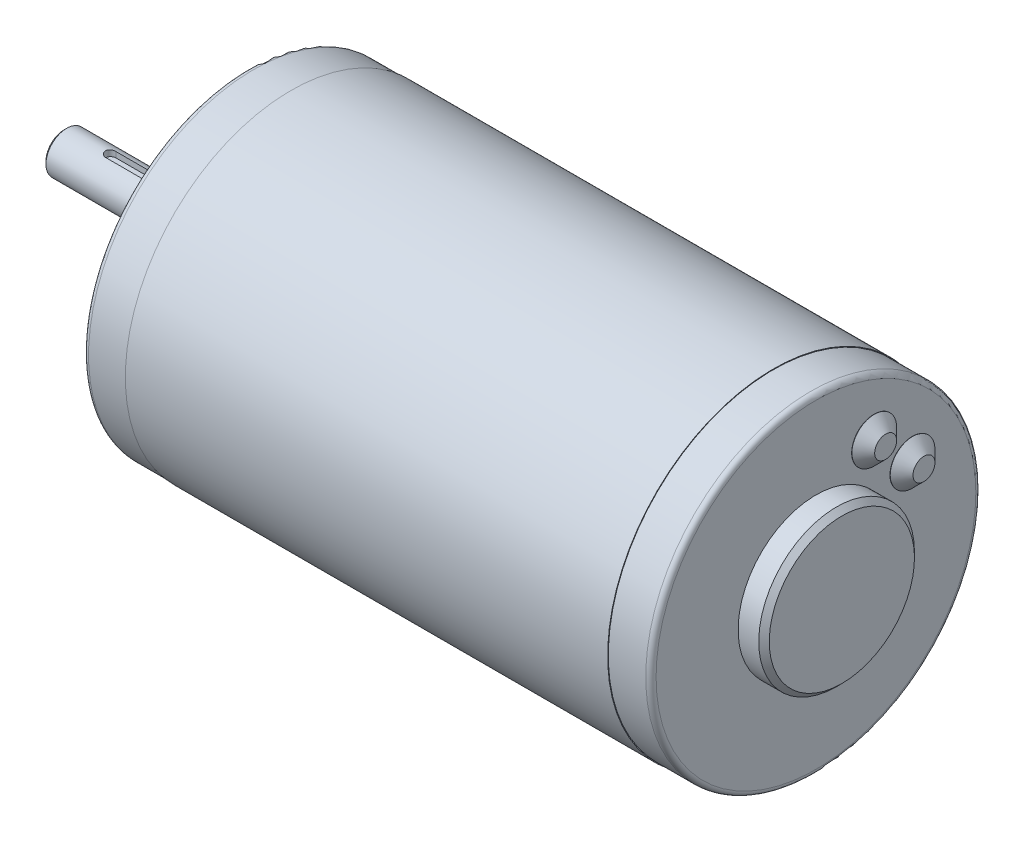
ISO-10303-21;
HEADER;
FILE_DESCRIPTION(('STEP AP214'),'2;1');
FILE_NAME('part.step','',(''),(''),'','','');
FILE_SCHEMA(('AUTOMOTIVE_DESIGN { 1 0 10303 214 1 1 1 1 }'));
ENDSEC;
DATA;
#1=APPLICATION_CONTEXT('core data for automotive mechanical design processes');
#2=APPLICATION_PROTOCOL_DEFINITION('international standard','automotive_design',2000,#1);
#3=PRODUCT_CONTEXT('',#1,'mechanical');
#4=PRODUCT('Part','Part','',(#3));
#5=PRODUCT_RELATED_PRODUCT_CATEGORY('part','',(#4));
#6=PRODUCT_DEFINITION_FORMATION('','',#4);
#7=PRODUCT_DEFINITION_CONTEXT('part definition',#1,'design');
#8=PRODUCT_DEFINITION('design','',#6,#7);
#9=PRODUCT_DEFINITION_SHAPE('','',#8);
#10=(LENGTH_UNIT() NAMED_UNIT(*) SI_UNIT(.MILLI.,.METRE.));
#11=(NAMED_UNIT(*) PLANE_ANGLE_UNIT() SI_UNIT($,.RADIAN.));
#12=(NAMED_UNIT(*) SI_UNIT($,.STERADIAN.) SOLID_ANGLE_UNIT());
#13=UNCERTAINTY_MEASURE_WITH_UNIT(LENGTH_MEASURE(1.E-05),#10,'distance_accuracy_value','');
#14=(GEOMETRIC_REPRESENTATION_CONTEXT(3) GLOBAL_UNCERTAINTY_ASSIGNED_CONTEXT((#13)) GLOBAL_UNIT_ASSIGNED_CONTEXT((#10,
#11,#12)) REPRESENTATION_CONTEXT('',''));
#15=CARTESIAN_POINT('',(0.,0.,0.));
#16=DIRECTION('',(0.,0.,1.));
#17=DIRECTION('',(1.,0.,0.));
#18=AXIS2_PLACEMENT_3D('',#15,#16,#17);
#19=CARTESIAN_POINT('',(-27.6,2.79999999999999,-1.));
#20=DIRECTION('',(0.,-1.,0.));
#21=DIRECTION('',(0.,0.,-1.));
#22=AXIS2_PLACEMENT_3D('',#19,#20,#21);
#23=PLANE('',#22);
#24=CARTESIAN_POINT('',(-7.1,2.79999999999999,0.));
#25=DIRECTION('',(0.,1.,0.));
#26=DIRECTION('',(0.,0.,1.));
#27=AXIS2_PLACEMENT_3D('',#24,#25,#26);
#28=CIRCLE('',#27,1.);
#29=CARTESIAN_POINT('',(-7.1,2.79999999999999,1.));
#30=VERTEX_POINT('',#29);
#31=CARTESIAN_POINT('',(-7.1,2.79999999999999,-1.));
#32=VERTEX_POINT('',#31);
#33=EDGE_CURVE('E79',#30,#32,#28,.T.);
#34=ORIENTED_EDGE('',*,*,#33,.T.);
#35=DIRECTION('',(1.,0.,0.));
#36=VECTOR('',#35,1.);
#37=CARTESIAN_POINT('',(-27.6,2.79999999999999,-1.));
#38=LINE('',#37,#36);
#39=CARTESIAN_POINT('',(-26.6,2.79999999999999,-1.));
#40=VERTEX_POINT('',#39);
#41=EDGE_CURVE('E74',#40,#32,#38,.T.);
#42=ORIENTED_EDGE('',*,*,#41,.F.);
#43=CARTESIAN_POINT('',(-26.6,2.79999999999999,0.));
#44=DIRECTION('',(0.,-1.,0.));
#45=DIRECTION('',(0.,0.,-1.));
#46=AXIS2_PLACEMENT_3D('',#43,#44,#45);
#47=CIRCLE('',#46,1.);
#48=CARTESIAN_POINT('',(-26.6,2.79999999999999,1.));
#49=VERTEX_POINT('',#48);
#50=EDGE_CURVE('E76',#40,#49,#47,.F.);
#51=ORIENTED_EDGE('',*,*,#50,.T.);
#52=DIRECTION('',(1.,0.,0.));
#53=VECTOR('',#52,1.);
#54=CARTESIAN_POINT('',(-27.6,2.79999999999999,1.));
#55=LINE('',#54,#53);
#56=EDGE_CURVE('E102',#49,#30,#55,.T.);
#57=ORIENTED_EDGE('',*,*,#56,.T.);
#58=EDGE_LOOP('',(#34,#42,#51,#57));
#59=FACE_BOUND('',#58,.T.);
#60=ADVANCED_FACE('F16',(#59),#23,.F.);
#61=CARTESIAN_POINT('',(-35.6,0.,0.));
#62=DIRECTION('',(-1.,0.,0.));
#63=DIRECTION('',(0.,0.,1.));
#64=AXIS2_PLACEMENT_3D('',#61,#62,#63);
#65=PLANE('',#64);
#66=CARTESIAN_POINT('',(-35.6000000000449,0.,0.));
#67=DIRECTION('',(1.,0.,0.));
#68=DIRECTION('',(0.,0.,-1.));
#69=AXIS2_PLACEMENT_3D('',#66,#67,#68);
#70=CIRCLE('',#69,3.49999999997408);
#71=CARTESIAN_POINT('',(-35.6000000000449,0.,-3.49999999997408));
#72=VERTEX_POINT('',#71);
#73=EDGE_CURVE('E325',#72,#72,#70,.T.);
#74=ORIENTED_EDGE('',*,*,#73,.F.);
#75=EDGE_LOOP('',(#74));
#76=FACE_BOUND('',#75,.T.);
#77=ADVANCED_FACE('F633',(#76),#65,.T.);
#78=CARTESIAN_POINT('',(-26.6,3.87298334620741,0.));
#79=DIRECTION('',(0.,-1.,0.));
#80=DIRECTION('',(0.,0.,-1.));
#81=AXIS2_PLACEMENT_3D('',#78,#79,#80);
#82=CYLINDRICAL_SURFACE('',#81,1.);
#83=CARTESIAN_POINT('',(-26.6,3.87298334620741,1.));
#84=CARTESIAN_POINT('',(-26.6276629851065,3.87298148580177,1.00000033749611));
#85=CARTESIAN_POINT('',(-26.6553122630182,3.8732800994947,0.998851407375366));
#86=CARTESIAN_POINT('',(-26.7104040353036,3.87445904774558,0.994271295395754));
#87=CARTESIAN_POINT('',(-26.7378465636871,3.87533928441687,0.990840497572679));
#88=CARTESIAN_POINT('',(-26.8194531732088,3.87881710972053,0.977175239382526));
#89=CARTESIAN_POINT('',(-26.8730564684822,3.88225203148808,0.963567695172493));
#90=CARTESIAN_POINT('',(-26.977124673782,3.89095422588002,0.927798076247996));
#91=CARTESIAN_POINT('',(-27.0275898782129,3.89622132630929,0.905636805423835));
#92=CARTESIAN_POINT('',(-27.1241114486473,3.90799134471939,0.853415378025864));
#93=CARTESIAN_POINT('',(-27.170166627891,3.91449459395647,0.823353103356932));
#94=CARTESIAN_POINT('',(-27.2575438819061,3.92816262398025,0.755484471828069));
#95=CARTESIAN_POINT('',(-27.2987548862455,3.93533791028915,0.717537268783975));
#96=CARTESIAN_POINT('',(-27.3743020894827,3.94945104396193,0.635275780516229));
#97=CARTESIAN_POINT('',(-27.4086371894679,3.95638885322537,0.59096047947883));
#98=CARTESIAN_POINT('',(-27.4699110016186,3.96936182283248,0.496456899401689));
#99=CARTESIAN_POINT('',(-27.496739895984,3.9753830468173,0.446195340334472));
#100=CARTESIAN_POINT('',(-27.5415247341967,3.98572346250588,0.341702590842916));
#101=CARTESIAN_POINT('',(-27.5594824242998,3.990042989147,0.287472184083007));
#102=CARTESIAN_POINT('',(-27.5856589927774,3.99641900005128,0.177744108525158));
#103=CARTESIAN_POINT('',(-27.5940676724228,3.998519529013,0.122294322002856));
#104=CARTESIAN_POINT('',(-27.6015033715433,4.00037438150815,0.0107327756816781));
#105=CARTESIAN_POINT('',(-27.6005315701923,4.00012899993444,-0.0453789000287067));
#106=CARTESIAN_POINT('',(-27.5893700363146,3.99735237365735,-0.155352492972096));
#107=CARTESIAN_POINT('',(-27.5793853834005,3.9948719867736,-0.209236701739855));
#108=CARTESIAN_POINT('',(-27.5508113208173,3.98796330636495,-0.31453871108434));
#109=CARTESIAN_POINT('',(-27.5322215304314,3.98353492665556,-0.365956402423988));
#110=CARTESIAN_POINT('',(-27.4867987193294,3.97314997761798,-0.46540728602454));
#111=CARTESIAN_POINT('',(-27.4598926057672,3.96717993827555,-0.513405629602248));
#112=CARTESIAN_POINT('',(-27.3986568701665,3.95435945541919,-0.604276631230015));
#113=CARTESIAN_POINT('',(-27.3643261297468,3.94750887933198,-0.64714851556229));
#114=CARTESIAN_POINT('',(-27.2881210879187,3.93345566022865,-0.727769389708492));
#115=CARTESIAN_POINT('',(-27.2460683634602,3.92624850477685,-0.765349103054128));
#116=CARTESIAN_POINT('',(-27.1561701330723,3.91246168284006,-0.832969575186237));
#117=CARTESIAN_POINT('',(-27.1083230467164,3.90588218842993,-0.863008270245062));
#118=CARTESIAN_POINT('',(-27.0078544021762,3.89407813586325,-0.914804709285961));
#119=CARTESIAN_POINT('',(-26.9552085351039,3.88886106009136,-0.936517017887269));
#120=CARTESIAN_POINT('',(-26.8468830715817,3.88047058807054,-0.970702351849828));
#121=CARTESIAN_POINT('',(-26.7912081448502,3.87729413761435,-0.983189189212131));
#122=CARTESIAN_POINT('',(-26.7125426192411,3.87455290681524,-0.993904635150938));
#123=CARTESIAN_POINT('',(-26.6900802967868,3.87396523110859,-0.996190790966708));
#124=CARTESIAN_POINT('',(-26.6450822100907,3.87318062488974,-0.999236757697394));
#125=CARTESIAN_POINT('',(-26.6225466240447,3.87298306219461,-0.999999038096045));
#126=CARTESIAN_POINT('',(-26.6,3.87298334620741,-1.));
#127=B_SPLINE_CURVE_WITH_KNOTS('',3,(#83,#84,#85,#86,#87,#88,#89,#90,#91,#92,#93,#94,#95,#96,
#97,#98,#99,#100,#101,#102,#103,#104,#105,#106,#107,#108,#109,#110,#111,#112,#113,#114,#115,
#116,#117,#118,#119,#120,#121,#122,#123,#124,#125,#126),.UNSPECIFIED.,.F.,.F.,(4,2,2,2,2,2,2,2,
2,2,2,2,2,2,2,2,2,2,2,2,2,4),(0.,0.0829365303397727,0.165859106084653,0.331229963080318,
0.496585282091499,0.661984974726751,0.830641897427976,0.999325753539196,1.17036187098235,
1.34136430732425,1.50890481515325,1.67642426256639,1.84022545479276,2.00403389475838,
2.16932509450376,2.33464120964329,2.50441429534542,2.67423379180967,2.84496720161068,
3.01544447539986,3.08315848722649,3.15076267731671),.UNSPECIFIED.);
#128=CARTESIAN_POINT('',(-26.6,3.87298334620741,1.));
#129=VERTEX_POINT('',#128);
#130=CARTESIAN_POINT('',(-26.6,3.87298334620741,-1.));
#131=VERTEX_POINT('',#130);
#132=EDGE_CURVE('E160',#129,#131,#127,.T.);
#133=ORIENTED_EDGE('',*,*,#132,.F.);
#134=DIRECTION('',(0.,1.,0.));
#135=VECTOR('',#134,1.);
#136=CARTESIAN_POINT('',(-26.6,2.79999999999999,1.));
#137=LINE('',#136,#135);
#138=EDGE_CURVE('E89',#129,#49,#137,.F.);
#139=ORIENTED_EDGE('',*,*,#138,.T.);
#140=ORIENTED_EDGE('',*,*,#50,.F.);
#141=DIRECTION('',(0.,1.,0.));
#142=VECTOR('',#141,1.);
#143=CARTESIAN_POINT('',(-26.6,2.79999999999999,-1.));
#144=LINE('',#143,#142);
#145=EDGE_CURVE('E83',#131,#40,#144,.F.);
#146=ORIENTED_EDGE('',*,*,#145,.F.);
#147=EDGE_LOOP('',(#133,#139,#140,#146));
#148=FACE_BOUND('',#147,.T.);
#149=ADVANCED_FACE('F86',(#148),#82,.F.);
#150=CARTESIAN_POINT('',(-27.6,2.79999999999999,-1.));
#151=DIRECTION('',(0.,0.,1.));
#152=DIRECTION('',(1.,0.,0.));
#153=AXIS2_PLACEMENT_3D('',#150,#151,#152);
#154=PLANE('',#153);
#155=DIRECTION('',(1.,0.,0.));
#156=VECTOR('',#155,1.);
#157=CARTESIAN_POINT('',(0.,3.87298334620741,-1.));
#158=LINE('',#157,#156);
#159=CARTESIAN_POINT('',(-7.1,3.87298334620741,-1.));
#160=VERTEX_POINT('',#159);
#161=EDGE_CURVE('E94',#131,#160,#158,.T.);
#162=ORIENTED_EDGE('',*,*,#161,.F.);
#163=ORIENTED_EDGE('',*,*,#145,.T.);
#164=ORIENTED_EDGE('',*,*,#41,.T.);
#165=DIRECTION('',(0.,1.,0.));
#166=VECTOR('',#165,1.);
#167=CARTESIAN_POINT('',(-7.1,2.79999999999999,-1.));
#168=LINE('',#167,#166);
#169=EDGE_CURVE('E97',#32,#160,#168,.T.);
#170=ORIENTED_EDGE('',*,*,#169,.T.);
#171=EDGE_LOOP('',(#162,#163,#164,#170));
#172=FACE_BOUND('',#171,.T.);
#173=ADVANCED_FACE('F92',(#172),#154,.T.);
#174=CARTESIAN_POINT('',(-7.1,2.79999999999999,0.));
#175=DIRECTION('',(0.,1.,0.));
#176=DIRECTION('',(0.,0.,1.));
#177=AXIS2_PLACEMENT_3D('',#174,#175,#176);
#178=CYLINDRICAL_SURFACE('',#177,1.);
#179=ORIENTED_EDGE('',*,*,#33,.F.);
#180=DIRECTION('',(0.,1.,0.));
#181=VECTOR('',#180,1.);
#182=CARTESIAN_POINT('',(-7.1,2.79999999999999,1.));
#183=LINE('',#182,#181);
#184=CARTESIAN_POINT('',(-7.1,3.87298334620741,1.));
#185=VERTEX_POINT('',#184);
#186=EDGE_CURVE('E103',#30,#185,#183,.T.);
#187=ORIENTED_EDGE('',*,*,#186,.T.);
#188=CARTESIAN_POINT('',(-7.1,3.87298334620741,-1.));
#189=CARTESIAN_POINT('',(-7.07233701489346,3.87298148580177,-1.00000033749611));
#190=CARTESIAN_POINT('',(-7.04468773698177,3.8732800994947,-0.998851407375366));
#191=CARTESIAN_POINT('',(-6.98959596469644,3.87445904774558,-0.994271295395754));
#192=CARTESIAN_POINT('',(-6.96215343631291,3.87533928441687,-0.990840497572679));
#193=CARTESIAN_POINT('',(-6.88054682679116,3.87881710972053,-0.977175239382526));
#194=CARTESIAN_POINT('',(-6.82694353151779,3.88225203148808,-0.963567695172493));
#195=CARTESIAN_POINT('',(-6.72287532621804,3.89095422588002,-0.927798076247997));
#196=CARTESIAN_POINT('',(-6.67241012178714,3.89622132630929,-0.905636805423836));
#197=CARTESIAN_POINT('',(-6.57588855135267,3.90799134471939,-0.853415378025865));
#198=CARTESIAN_POINT('',(-6.52983337210904,3.91449459395647,-0.823353103356933));
#199=CARTESIAN_POINT('',(-6.4424561180939,3.92816262398025,-0.755484471828069));
#200=CARTESIAN_POINT('',(-6.40124511375448,3.93533791028915,-0.717537268783976));
#201=CARTESIAN_POINT('',(-6.32569791051729,3.94945104396193,-0.63527578051623));
#202=CARTESIAN_POINT('',(-6.29136281053206,3.95638885322537,-0.590960479478831));
#203=CARTESIAN_POINT('',(-6.23008899838136,3.96936182283248,-0.496456899401691));
#204=CARTESIAN_POINT('',(-6.20326010401603,3.9753830468173,-0.446195340334474));
#205=CARTESIAN_POINT('',(-6.1584752658033,3.98572346250588,-0.341702590842919));
#206=CARTESIAN_POINT('',(-6.14051757570017,3.990042989147,-0.28747218408301));
#207=CARTESIAN_POINT('',(-6.11434100722257,3.99641900005128,-0.17774410852516));
#208=CARTESIAN_POINT('',(-6.10593232757718,3.998519529013,-0.122294322002858));
#209=CARTESIAN_POINT('',(-6.09849662845671,4.00037438150815,-0.0107327756816796));
#210=CARTESIAN_POINT('',(-6.09946842980766,4.00012899993444,0.0453789000287057));
#211=CARTESIAN_POINT('',(-6.11062996368545,3.99735237365735,0.155352492972096));
#212=CARTESIAN_POINT('',(-6.12061461659948,3.9948719867736,0.209236701739855));
#213=CARTESIAN_POINT('',(-6.14918867918275,3.98796330636495,0.31453871108434));
#214=CARTESIAN_POINT('',(-6.16777846956858,3.98353492665556,0.365956402423988));
#215=CARTESIAN_POINT('',(-6.21320128067065,3.97314997761798,0.465407286024539));
#216=CARTESIAN_POINT('',(-6.24010739423284,3.96717993827555,0.513405629602248));
#217=CARTESIAN_POINT('',(-6.30134312983347,3.95435945541919,0.604276631230014));
#218=CARTESIAN_POINT('',(-6.33567387025322,3.94750887933198,0.647148515562289));
#219=CARTESIAN_POINT('',(-6.41187891208131,3.93345566022865,0.72776938970849));
#220=CARTESIAN_POINT('',(-6.45393163653981,3.92624850477685,0.765349103054127));
#221=CARTESIAN_POINT('',(-6.54382986692773,3.91246168284006,0.832969575186237));
#222=CARTESIAN_POINT('',(-6.59167695328356,3.90588218842993,0.863008270245062));
#223=CARTESIAN_POINT('',(-6.69214559782377,3.89407813586325,0.914804709285962));
#224=CARTESIAN_POINT('',(-6.74479146489609,3.88886106009136,0.936517017887269));
#225=CARTESIAN_POINT('',(-6.85311692841829,3.88047058807055,0.970702351849829));
#226=CARTESIAN_POINT('',(-6.90879185514984,3.87729413761435,0.983189189212132));
#227=CARTESIAN_POINT('',(-6.9874573807589,3.87455290681524,0.993904635150938));
#228=CARTESIAN_POINT('',(-7.00991970321318,3.87396523110859,0.996190790966708));
#229=CARTESIAN_POINT('',(-7.05491778990932,3.87318062488974,0.999236757697394));
#230=CARTESIAN_POINT('',(-7.07745337595529,3.87298306219461,0.999999038096045));
#231=CARTESIAN_POINT('',(-7.1,3.87298334620741,1.));
#232=B_SPLINE_CURVE_WITH_KNOTS('',3,(#188,#189,#190,#191,#192,#193,#194,#195,#196,#197,#198,
#199,#200,#201,#202,#203,#204,#205,#206,#207,#208,#209,#210,#211,#212,#213,#214,#215,#216,#217,
#218,#219,#220,#221,#222,#223,#224,#225,#226,#227,#228,#229,#230,#231),.UNSPECIFIED.,.F.,.F.,(4,
2,2,2,2,2,2,2,2,2,2,2,2,2,2,2,2,2,2,2,2,4),(0.,0.0829365303397693,0.165859106084651,
0.331229963080317,0.496585282091498,0.661984974726749,0.830641897427974,0.999325753539193,
1.17036187098235,1.34136430732424,1.50890481515325,1.67642426256639,1.84022545479276,
2.00403389475838,2.16932509450376,2.33464120964329,2.50441429534542,2.67423379180967,
2.84496720161068,3.01544447539986,3.08315848722648,3.15076267731671),.UNSPECIFIED.);
#233=EDGE_CURVE('E151',#160,#185,#232,.T.);
#234=ORIENTED_EDGE('',*,*,#233,.F.);
#235=ORIENTED_EDGE('',*,*,#169,.F.);
#236=EDGE_LOOP('',(#179,#187,#234,#235));
#237=FACE_BOUND('',#236,.T.);
#238=ADVANCED_FACE('F166',(#237),#178,.F.);
#239=CARTESIAN_POINT('',(-27.6,2.79999999999999,1.));
#240=DIRECTION('',(0.,0.,1.));
#241=DIRECTION('',(1.,0.,0.));
#242=AXIS2_PLACEMENT_3D('',#239,#240,#241);
#243=PLANE('',#242);
#244=ORIENTED_EDGE('',*,*,#186,.F.);
#245=ORIENTED_EDGE('',*,*,#56,.F.);
#246=ORIENTED_EDGE('',*,*,#138,.F.);
#247=DIRECTION('',(1.,0.,0.));
#248=VECTOR('',#247,1.);
#249=CARTESIAN_POINT('',(0.,3.87298334620741,1.));
#250=LINE('',#249,#248);
#251=EDGE_CURVE('E159',#185,#129,#250,.F.);
#252=ORIENTED_EDGE('',*,*,#251,.F.);
#253=EDGE_LOOP('',(#244,#245,#246,#252));
#254=FACE_BOUND('',#253,.T.);
#255=ADVANCED_FACE('F181',(#254),#243,.F.);
#256=CARTESIAN_POINT('',(-35.0999999999999,0.,0.));
#257=DIRECTION('',(1.,0.,0.));
#258=DIRECTION('',(0.,0.,-1.));
#259=AXIS2_PLACEMENT_3D('',#256,#257,#258);
#260=CONICAL_SURFACE('',#259,3.99999999996226,0.785398163340605);
#261=ORIENTED_EDGE('',*,*,#73,.T.);
#262=EDGE_LOOP('',(#261));
#263=FACE_BOUND('',#262,.T.);
#264=CARTESIAN_POINT('',(-35.1,0.,0.));
#265=DIRECTION('',(1.,0.,0.));
#266=DIRECTION('',(0.,0.,-1.));
#267=AXIS2_PLACEMENT_3D('',#264,#265,#266);
#268=CIRCLE('',#267,4.);
#269=CARTESIAN_POINT('',(-35.1,0.,-4.));
#270=VERTEX_POINT('',#269);
#271=EDGE_CURVE('E150',#270,#270,#268,.T.);
#272=ORIENTED_EDGE('',*,*,#271,.F.);
#273=EDGE_LOOP('',(#272));
#274=FACE_BOUND('',#273,.T.);
#275=ADVANCED_FACE('F176',(#263,#274),#260,.T.);
#276=CARTESIAN_POINT('',(0.,0.,0.));
#277=DIRECTION('',(1.,0.,0.));
#278=DIRECTION('',(0.,0.,-1.));
#279=AXIS2_PLACEMENT_3D('',#276,#277,#278);
#280=CYLINDRICAL_SURFACE('',#279,4.);
#281=ORIENTED_EDGE('',*,*,#271,.T.);
#282=EDGE_LOOP('',(#281));
#283=FACE_BOUND('',#282,.T.);
#284=CARTESIAN_POINT('',(-4.,0.,0.));
#285=DIRECTION('',(1.,0.,0.));
#286=DIRECTION('',(0.,0.,-1.));
#287=AXIS2_PLACEMENT_3D('',#284,#285,#286);
#288=CIRCLE('',#287,4.);
#289=CARTESIAN_POINT('',(-4.,0.,-4.));
#290=VERTEX_POINT('',#289);
#291=EDGE_CURVE('E147',#290,#290,#288,.T.);
#292=ORIENTED_EDGE('',*,*,#291,.F.);
#293=EDGE_LOOP('',(#292));
#294=FACE_BOUND('',#293,.T.);
#295=ORIENTED_EDGE('',*,*,#233,.T.);
#296=ORIENTED_EDGE('',*,*,#251,.T.);
#297=ORIENTED_EDGE('',*,*,#132,.T.);
#298=ORIENTED_EDGE('',*,*,#161,.T.);
#299=EDGE_LOOP('',(#295,#296,#297,#298));
#300=FACE_BOUND('',#299,.T.);
#301=ADVANCED_FACE('F170',(#283,#294,#300),#280,.T.);
#302=CARTESIAN_POINT('',(-4.,4.,0.));
#303=DIRECTION('',(-1.,0.,0.));
#304=DIRECTION('',(0.,0.,1.));
#305=AXIS2_PLACEMENT_3D('',#302,#303,#304);
#306=PLANE('',#305);
#307=ORIENTED_EDGE('',*,*,#291,.T.);
#308=EDGE_LOOP('',(#307));
#309=FACE_BOUND('',#308,.T.);
#310=CARTESIAN_POINT('',(-4.,0.,0.));
#311=DIRECTION('',(1.,0.,0.));
#312=DIRECTION('',(0.,1.,0.));
#313=AXIS2_PLACEMENT_3D('',#310,#311,#312);
#314=CIRCLE('',#313,8.509);
#315=CARTESIAN_POINT('',(-4.,8.509,0.));
#316=VERTEX_POINT('',#315);
#317=EDGE_CURVE('E144',#316,#316,#314,.T.);
#318=ORIENTED_EDGE('',*,*,#317,.F.);
#319=EDGE_LOOP('',(#318));
#320=FACE_BOUND('',#319,.T.);
#321=ADVANCED_FACE('F175',(#309,#320),#306,.T.);
#322=CARTESIAN_POINT('',(111.8479,18.6070906828553,-11.2073596390943));
#323=DIRECTION('',(1.,0.,0.));
#324=DIRECTION('',(0.,0.,-1.));
#325=AXIS2_PLACEMENT_3D('',#322,#323,#324);
#326=PLANE('',#325);
#327=CARTESIAN_POINT('',(111.84789999993,18.6070906828553,-11.2073596390943));
#328=DIRECTION('',(-1.,0.,0.));
#329=DIRECTION('',(0.,-1.,0.));
#330=AXIS2_PLACEMENT_3D('',#327,#328,#329);
#331=CIRCLE('',#330,2.11800000003146);
#332=CARTESIAN_POINT('',(111.84789999993,16.4890906828238,-11.2073596390943));
#333=VERTEX_POINT('',#332);
#334=EDGE_CURVE('E141',#333,#333,#331,.T.);
#335=ORIENTED_EDGE('',*,*,#334,.F.);
#336=EDGE_LOOP('',(#335));
#337=FACE_BOUND('',#336,.T.);
#338=ADVANCED_FACE('F581',(#337),#326,.T.);
#339=CARTESIAN_POINT('',(114.6,15.0368,0.));
#340=DIRECTION('',(1.,0.,0.));
#341=DIRECTION('',(0.,0.,-1.));
#342=AXIS2_PLACEMENT_3D('',#339,#340,#341);
#343=PLANE('',#342);
#344=CARTESIAN_POINT('',(114.6,0.,0.));
#345=DIRECTION('',(-1.,0.,0.));
#346=DIRECTION('',(0.,-1.,0.));
#347=AXIS2_PLACEMENT_3D('',#344,#345,#346);
#348=CIRCLE('',#347,14.0208);
#349=CARTESIAN_POINT('',(114.6,-14.0208,0.));
#350=VERTEX_POINT('',#349);
#351=EDGE_CURVE('E138',#350,#350,#348,.T.);
#352=ORIENTED_EDGE('',*,*,#351,.F.);
#353=EDGE_LOOP('',(#352));
#354=FACE_BOUND('',#353,.T.);
#355=ADVANCED_FACE('F573',(#354),#343,.T.);
#356=CARTESIAN_POINT('',(111.8479,11.2073596390943,-18.6070906828553));
#357=DIRECTION('',(1.,0.,0.));
#358=DIRECTION('',(0.,0.,-1.));
#359=AXIS2_PLACEMENT_3D('',#356,#357,#358);
#360=PLANE('',#359);
#361=CARTESIAN_POINT('',(111.84789999993,11.2073596390943,-18.6070906828553));
#362=DIRECTION('',(-1.,0.,0.));
#363=DIRECTION('',(0.,0.,1.));
#364=AXIS2_PLACEMENT_3D('',#361,#362,#363);
#365=CIRCLE('',#364,2.1180000000021);
#366=CARTESIAN_POINT('',(111.84789999993,11.2073596390943,-16.4890906828532));
#367=VERTEX_POINT('',#366);
#368=EDGE_CURVE('E134',#367,#367,#365,.T.);
#369=ORIENTED_EDGE('',*,*,#368,.F.);
#370=EDGE_LOOP('',(#369));
#371=FACE_BOUND('',#370,.T.);
#372=ADVANCED_FACE('F363',(#371),#360,.T.);
#373=CARTESIAN_POINT('',(13.6143999999945,25.4,0.));
#374=DIRECTION('',(-1.,0.,0.));
#375=DIRECTION('',(0.,0.,1.));
#376=AXIS2_PLACEMENT_3D('',#373,#374,#375);
#377=CONICAL_SURFACE('',#376,2.01929999997219,1.02974425867198);
#378=CARTESIAN_POINT('',(14.827717847993,25.4,0.));
#379=VERTEX_POINT('',#378);
#380=VERTEX_LOOP('',#379);
#381=FACE_BOUND('',#380,.T.);
#382=CARTESIAN_POINT('',(13.6144,25.4,0.));
#383=DIRECTION('',(-1.,0.,0.));
#384=DIRECTION('',(0.,0.,1.));
#385=AXIS2_PLACEMENT_3D('',#382,#383,#384);
#386=CIRCLE('',#385,2.0193);
#387=CARTESIAN_POINT('',(13.6144,25.4,2.0193));
#388=VERTEX_POINT('',#387);
#389=EDGE_CURVE('E137',#388,#388,#386,.T.);
#390=ORIENTED_EDGE('',*,*,#389,.T.);
#391=EDGE_LOOP('',(#390));
#392=FACE_BOUND('',#391,.T.);
#393=ADVANCED_FACE('F360',(#381,#392),#377,.F.);
#394=CARTESIAN_POINT('',(13.6143999999945,-25.4,0.));
#395=DIRECTION('',(-1.,0.,0.));
#396=DIRECTION('',(0.,0.,1.));
#397=AXIS2_PLACEMENT_3D('',#394,#395,#396);
#398=CONICAL_SURFACE('',#397,2.01929999997219,1.02974425867198);
#399=CARTESIAN_POINT('',(14.827717847993,-25.4,0.));
#400=VERTEX_POINT('',#399);
#401=VERTEX_LOOP('',#400);
#402=FACE_BOUND('',#401,.T.);
#403=CARTESIAN_POINT('',(13.6144,-25.4,0.));
#404=DIRECTION('',(-1.,0.,0.));
#405=DIRECTION('',(0.,0.,1.));
#406=AXIS2_PLACEMENT_3D('',#403,#404,#405);
#407=CIRCLE('',#406,2.0193);
#408=CARTESIAN_POINT('',(13.6144,-25.4,2.0193));
#409=VERTEX_POINT('',#408);
#410=EDGE_CURVE('E315',#409,#409,#407,.T.);
#411=ORIENTED_EDGE('',*,*,#410,.T.);
#412=EDGE_LOOP('',(#411));
#413=FACE_BOUND('',#412,.T.);
#414=ADVANCED_FACE('F356',(#402,#413),#398,.F.);
#415=CARTESIAN_POINT('',(-2.984,0.,0.));
#416=DIRECTION('',(1.,0.,0.));
#417=DIRECTION('',(0.,1.,0.));
#418=AXIS2_PLACEMENT_3D('',#415,#416,#417);
#419=CONICAL_SURFACE('',#418,9.525,0.78539816339745);
#420=ORIENTED_EDGE('',*,*,#317,.T.);
#421=EDGE_LOOP('',(#420));
#422=FACE_BOUND('',#421,.T.);
#423=CARTESIAN_POINT('',(-2.984,0.,0.));
#424=DIRECTION('',(1.,0.,0.));
#425=DIRECTION('',(0.,0.,-1.));
#426=AXIS2_PLACEMENT_3D('',#423,#424,#425);
#427=CIRCLE('',#426,9.525);
#428=CARTESIAN_POINT('',(-2.984,0.,-9.525));
#429=VERTEX_POINT('',#428);
#430=EDGE_CURVE('E312',#429,#429,#427,.T.);
#431=ORIENTED_EDGE('',*,*,#430,.F.);
#432=EDGE_LOOP('',(#431));
#433=FACE_BOUND('',#432,.T.);
#434=ADVANCED_FACE('F380',(#422,#433),#419,.T.);
#435=CARTESIAN_POINT('',(109.647900000027,18.6070906828553,-11.2073596390943));
#436=DIRECTION('',(-1.,0.,0.));
#437=DIRECTION('',(0.,-1.,0.));
#438=AXIS2_PLACEMENT_3D('',#435,#436,#437);
#439=CONICAL_SURFACE('',#438,4.31799999987712,0.785398163384529);
#440=CARTESIAN_POINT('',(109.6479,18.6070906828553,-11.2073596390943));
#441=DIRECTION('',(-1.,0.,0.));
#442=DIRECTION('',(0.,0.,1.));
#443=AXIS2_PLACEMENT_3D('',#440,#441,#442);
#444=CIRCLE('',#443,4.318);
#445=CARTESIAN_POINT('',(109.6479,18.6070906828553,-6.88935963909434));
#446=VERTEX_POINT('',#445);
#447=EDGE_CURVE('E309',#446,#446,#444,.T.);
#448=ORIENTED_EDGE('',*,*,#447,.F.);
#449=EDGE_LOOP('',(#448));
#450=FACE_BOUND('',#449,.T.);
#451=ORIENTED_EDGE('',*,*,#334,.T.);
#452=EDGE_LOOP('',(#451));
#453=FACE_BOUND('',#452,.T.);
#454=ADVANCED_FACE('F389',(#450,#453),#439,.T.);
#455=CARTESIAN_POINT('',(113.584,0.,0.));
#456=DIRECTION('',(-1.,0.,0.));
#457=DIRECTION('',(0.,-1.,0.));
#458=AXIS2_PLACEMENT_3D('',#455,#456,#457);
#459=CONICAL_SURFACE('',#458,15.0368,0.785398163397441);
#460=ORIENTED_EDGE('',*,*,#351,.T.);
#461=EDGE_LOOP('',(#460));
#462=FACE_BOUND('',#461,.T.);
#463=CARTESIAN_POINT('',(113.584,0.,0.));
#464=DIRECTION('',(1.,0.,0.));
#465=DIRECTION('',(0.,0.,-1.));
#466=AXIS2_PLACEMENT_3D('',#463,#464,#465);
#467=CIRCLE('',#466,15.0368);
#468=CARTESIAN_POINT('',(113.584,0.,-15.0368));
#469=VERTEX_POINT('',#468);
#470=EDGE_CURVE('E306',#469,#469,#467,.F.);
#471=ORIENTED_EDGE('',*,*,#470,.F.);
#472=EDGE_LOOP('',(#471));
#473=FACE_BOUND('',#472,.T.);
#474=ADVANCED_FACE('F401',(#462,#473),#459,.T.);
#475=CARTESIAN_POINT('',(109.647900000084,11.2073596390943,-18.6070906828553));
#476=DIRECTION('',(-1.,0.,0.));
#477=DIRECTION('',(0.,0.,1.));
#478=AXIS2_PLACEMENT_3D('',#475,#476,#477);
#479=CONICAL_SURFACE('',#478,4.31799999990461,0.785398163410367);
#480=CARTESIAN_POINT('',(109.6479,11.2073596390943,-18.6070906828553));
#481=DIRECTION('',(-1.,0.,0.));
#482=DIRECTION('',(0.,0.,1.));
#483=AXIS2_PLACEMENT_3D('',#480,#481,#482);
#484=CIRCLE('',#483,4.318);
#485=CARTESIAN_POINT('',(109.6479,11.2073596390943,-14.2890906828553));
#486=VERTEX_POINT('',#485);
#487=EDGE_CURVE('E133',#486,#486,#484,.T.);
#488=ORIENTED_EDGE('',*,*,#487,.F.);
#489=EDGE_LOOP('',(#488));
#490=FACE_BOUND('',#489,.T.);
#491=ORIENTED_EDGE('',*,*,#368,.T.);
#492=EDGE_LOOP('',(#491));
#493=FACE_BOUND('',#492,.T.);
#494=ADVANCED_FACE('F412',(#490,#493),#479,.T.);
#495=CARTESIAN_POINT('',(0.,25.4,0.));
#496=DIRECTION('',(-1.,0.,0.));
#497=DIRECTION('',(0.,0.,1.));
#498=AXIS2_PLACEMENT_3D('',#495,#496,#497);
#499=CYLINDRICAL_SURFACE('',#498,2.0193);
#500=CARTESIAN_POINT('',(0.,25.4,0.));
#501=DIRECTION('',(-1.,0.,0.));
#502=DIRECTION('',(0.,0.,1.));
#503=AXIS2_PLACEMENT_3D('',#500,#501,#502);
#504=CIRCLE('',#503,2.0193);
#505=CARTESIAN_POINT('',(0.,25.4,2.0193));
#506=VERTEX_POINT('',#505);
#507=EDGE_CURVE('E130',#506,#506,#504,.F.);
#508=ORIENTED_EDGE('',*,*,#507,.F.);
#509=EDGE_LOOP('',(#508));
#510=FACE_BOUND('',#509,.T.);
#511=ORIENTED_EDGE('',*,*,#389,.F.);
#512=EDGE_LOOP('',(#511));
#513=FACE_BOUND('',#512,.T.);
#514=ADVANCED_FACE('F424',(#510,#513),#499,.F.);
#515=CARTESIAN_POINT('',(0.,-25.4,0.));
#516=DIRECTION('',(-1.,0.,0.));
#517=DIRECTION('',(0.,0.,1.));
#518=AXIS2_PLACEMENT_3D('',#515,#516,#517);
#519=CYLINDRICAL_SURFACE('',#518,2.0193);
#520=CARTESIAN_POINT('',(0.,-25.4,0.));
#521=DIRECTION('',(-1.,0.,0.));
#522=DIRECTION('',(0.,0.,1.));
#523=AXIS2_PLACEMENT_3D('',#520,#521,#522);
#524=CIRCLE('',#523,2.0193);
#525=CARTESIAN_POINT('',(0.,-25.4,2.0193));
#526=VERTEX_POINT('',#525);
#527=EDGE_CURVE('E127',#526,#526,#524,.F.);
#528=ORIENTED_EDGE('',*,*,#527,.F.);
#529=EDGE_LOOP('',(#528));
#530=FACE_BOUND('',#529,.T.);
#531=ORIENTED_EDGE('',*,*,#410,.F.);
#532=EDGE_LOOP('',(#531));
#533=FACE_BOUND('',#532,.T.);
#534=ADVANCED_FACE('F434',(#530,#533),#519,.F.);
#535=CARTESIAN_POINT('',(0.,0.,0.));
#536=DIRECTION('',(1.,0.,0.));
#537=DIRECTION('',(0.,0.,-1.));
#538=AXIS2_PLACEMENT_3D('',#535,#536,#537);
#539=CYLINDRICAL_SURFACE('',#538,9.525);
#540=ORIENTED_EDGE('',*,*,#430,.T.);
#541=EDGE_LOOP('',(#540));
#542=FACE_BOUND('',#541,.T.);
#543=CARTESIAN_POINT('',(0.,0.,0.));
#544=DIRECTION('',(1.,0.,0.));
#545=DIRECTION('',(0.,0.,-1.));
#546=AXIS2_PLACEMENT_3D('',#543,#544,#545);
#547=CIRCLE('',#546,9.525);
#548=CARTESIAN_POINT('',(0.,0.,-9.525));
#549=VERTEX_POINT('',#548);
#550=EDGE_CURVE('E124',#549,#549,#547,.T.);
#551=ORIENTED_EDGE('',*,*,#550,.F.);
#552=EDGE_LOOP('',(#551));
#553=FACE_BOUND('',#552,.T.);
#554=ADVANCED_FACE('F444',(#542,#553),#539,.T.);
#555=CARTESIAN_POINT('',(111.8479,18.6070906828553,-11.2073596390943));
#556=DIRECTION('',(-1.,0.,0.));
#557=DIRECTION('',(0.,0.,1.));
#558=AXIS2_PLACEMENT_3D('',#555,#556,#557);
#559=CYLINDRICAL_SURFACE('',#558,4.318);
#560=CARTESIAN_POINT('',(109.6,18.6070906828553,-11.2073596390943));
#561=DIRECTION('',(-1.,0.,0.));
#562=DIRECTION('',(0.,0.,1.));
#563=AXIS2_PLACEMENT_3D('',#560,#561,#562);
#564=CIRCLE('',#563,4.318);
#565=CARTESIAN_POINT('',(109.6,18.6070906828553,-6.88935963909434));
#566=VERTEX_POINT('',#565);
#567=EDGE_CURVE('E121',#566,#566,#564,.T.);
#568=ORIENTED_EDGE('',*,*,#567,.F.);
#569=EDGE_LOOP('',(#568));
#570=FACE_BOUND('',#569,.T.);
#571=ORIENTED_EDGE('',*,*,#447,.T.);
#572=EDGE_LOOP('',(#571));
#573=FACE_BOUND('',#572,.T.);
#574=ADVANCED_FACE('F453',(#570,#573),#559,.T.);
#575=CARTESIAN_POINT('',(0.,0.,0.));
#576=DIRECTION('',(1.,0.,0.));
#577=DIRECTION('',(0.,0.,-1.));
#578=AXIS2_PLACEMENT_3D('',#575,#576,#577);
#579=CYLINDRICAL_SURFACE('',#578,15.0368);
#580=CARTESIAN_POINT('',(109.6,0.,0.));
#581=DIRECTION('',(1.,0.,0.));
#582=DIRECTION('',(0.,0.,-1.));
#583=AXIS2_PLACEMENT_3D('',#580,#581,#582);
#584=CIRCLE('',#583,15.0368);
#585=CARTESIAN_POINT('',(109.6,0.,-15.0368));
#586=VERTEX_POINT('',#585);
#587=EDGE_CURVE('E118',#586,#586,#584,.F.);
#588=ORIENTED_EDGE('',*,*,#587,.F.);
#589=EDGE_LOOP('',(#588));
#590=FACE_BOUND('',#589,.T.);
#591=ORIENTED_EDGE('',*,*,#470,.T.);
#592=EDGE_LOOP('',(#591));
#593=FACE_BOUND('',#592,.T.);
#594=ADVANCED_FACE('F463',(#590,#593),#579,.T.);
#595=CARTESIAN_POINT('',(111.8479,11.2073596390943,-18.6070906828553));
#596=DIRECTION('',(-1.,0.,0.));
#597=DIRECTION('',(0.,0.,1.));
#598=AXIS2_PLACEMENT_3D('',#595,#596,#597);
#599=CYLINDRICAL_SURFACE('',#598,4.318);
#600=CARTESIAN_POINT('',(109.6,11.2073596390943,-18.6070906828553));
#601=DIRECTION('',(-1.,0.,0.));
#602=DIRECTION('',(0.,0.,1.));
#603=AXIS2_PLACEMENT_3D('',#600,#601,#602);
#604=CIRCLE('',#603,4.318);
#605=CARTESIAN_POINT('',(109.6,11.2073596390943,-14.2890906828553));
#606=VERTEX_POINT('',#605);
#607=EDGE_CURVE('E114',#606,#606,#604,.T.);
#608=ORIENTED_EDGE('',*,*,#607,.F.);
#609=EDGE_LOOP('',(#608));
#610=FACE_BOUND('',#609,.T.);
#611=ORIENTED_EDGE('',*,*,#487,.T.);
#612=EDGE_LOOP('',(#611));
#613=FACE_BOUND('',#612,.T.);
#614=ADVANCED_FACE('F471',(#610,#613),#599,.T.);
#615=CARTESIAN_POINT('',(0.,9.525,0.));
#616=DIRECTION('',(-1.,0.,0.));
#617=DIRECTION('',(0.,0.,1.));
#618=AXIS2_PLACEMENT_3D('',#615,#616,#617);
#619=PLANE('',#618);
#620=ORIENTED_EDGE('',*,*,#550,.T.);
#621=EDGE_LOOP('',(#620));
#622=FACE_BOUND('',#621,.T.);
#623=CARTESIAN_POINT('',(0.,0.,0.));
#624=DIRECTION('',(1.,0.,0.));
#625=DIRECTION('',(0.,0.,-1.));
#626=AXIS2_PLACEMENT_3D('',#623,#624,#625);
#627=CIRCLE('',#626,30.877);
#628=CARTESIAN_POINT('',(0.,0.,-30.877));
#629=VERTEX_POINT('',#628);
#630=CARTESIAN_POINT('',(0.,0.,30.877));
#631=VERTEX_POINT('',#630);
#632=EDGE_CURVE('E117',#629,#631,#627,.T.);
#633=ORIENTED_EDGE('',*,*,#632,.F.);
#634=CARTESIAN_POINT('',(0.,0.,0.));
#635=DIRECTION('',(1.,0.,0.));
#636=DIRECTION('',(0.,0.,1.));
#637=AXIS2_PLACEMENT_3D('',#634,#635,#636);
#638=CIRCLE('',#637,30.877);
#639=EDGE_CURVE('E285',#631,#629,#638,.T.);
#640=ORIENTED_EDGE('',*,*,#639,.F.);
#641=EDGE_LOOP('',(#633,#640));
#642=FACE_BOUND('',#641,.T.);
#643=ORIENTED_EDGE('',*,*,#527,.T.);
#644=EDGE_LOOP('',(#643));
#645=FACE_BOUND('',#644,.T.);
#646=ORIENTED_EDGE('',*,*,#507,.T.);
#647=EDGE_LOOP('',(#646));
#648=FACE_BOUND('',#647,.T.);
#649=ADVANCED_FACE('F251',(#622,#642,#645,#648),#619,.T.);
#650=CARTESIAN_POINT('',(109.6,31.877,0.));
#651=DIRECTION('',(1.,0.,0.));
#652=DIRECTION('',(0.,0.,-1.));
#653=AXIS2_PLACEMENT_3D('',#650,#651,#652);
#654=PLANE('',#653);
#655=ORIENTED_EDGE('',*,*,#607,.T.);
#656=EDGE_LOOP('',(#655));
#657=FACE_BOUND('',#656,.T.);
#658=ORIENTED_EDGE('',*,*,#587,.T.);
#659=EDGE_LOOP('',(#658));
#660=FACE_BOUND('',#659,.T.);
#661=CARTESIAN_POINT('',(109.6,0.,0.));
#662=DIRECTION('',(-1.,0.,0.));
#663=DIRECTION('',(0.,0.,1.));
#664=AXIS2_PLACEMENT_3D('',#661,#662,#663);
#665=CIRCLE('',#664,30.877);
#666=CARTESIAN_POINT('',(109.6,0.,30.877));
#667=VERTEX_POINT('',#666);
#668=CARTESIAN_POINT('',(109.6,0.,-30.877));
#669=VERTEX_POINT('',#668);
#670=EDGE_CURVE('E35',#667,#669,#665,.T.);
#671=ORIENTED_EDGE('',*,*,#670,.F.);
#672=CARTESIAN_POINT('',(109.6,0.,0.));
#673=DIRECTION('',(-1.,0.,0.));
#674=DIRECTION('',(0.,0.,-1.));
#675=AXIS2_PLACEMENT_3D('',#672,#673,#674);
#676=CIRCLE('',#675,30.877);
#677=EDGE_CURVE('E233',#669,#667,#676,.T.);
#678=ORIENTED_EDGE('',*,*,#677,.F.);
#679=EDGE_LOOP('',(#671,#678));
#680=FACE_BOUND('',#679,.T.);
#681=ORIENTED_EDGE('',*,*,#567,.T.);
#682=EDGE_LOOP('',(#681));
#683=FACE_BOUND('',#682,.T.);
#684=ADVANCED_FACE('F242',(#657,#660,#680,#683),#654,.T.);
#685=CARTESIAN_POINT('',(0.999999999999999,0.,0.));
#686=DIRECTION('',(-1.,0.,0.));
#687=DIRECTION('',(0.,0.,1.));
#688=AXIS2_PLACEMENT_3D('',#685,#686,#687);
#689=TOROIDAL_SURFACE('',#688,30.877,1.);
#690=CARTESIAN_POINT('',(0.999999999999999,0.,0.));
#691=DIRECTION('',(1.,0.,0.));
#692=DIRECTION('',(0.,0.,-1.));
#693=AXIS2_PLACEMENT_3D('',#690,#691,#692);
#694=CIRCLE('',#693,31.877);
#695=CARTESIAN_POINT('',(0.999999999999999,0.,-31.877));
#696=VERTEX_POINT('',#695);
#697=EDGE_CURVE('E231',#696,#696,#694,.T.);
#698=ORIENTED_EDGE('',*,*,#697,.F.);
#699=EDGE_LOOP('',(#698));
#700=FACE_BOUND('',#699,.T.);
#701=ORIENTED_EDGE('',*,*,#639,.T.);
#702=ORIENTED_EDGE('',*,*,#632,.T.);
#703=EDGE_LOOP('',(#701,#702));
#704=FACE_BOUND('',#703,.T.);
#705=ADVANCED_FACE('F220',(#700,#704),#689,.T.);
#706=CARTESIAN_POINT('',(108.6,0.,0.));
#707=DIRECTION('',(1.,0.,0.));
#708=DIRECTION('',(0.,0.,-1.));
#709=AXIS2_PLACEMENT_3D('',#706,#707,#708);
#710=TOROIDAL_SURFACE('',#709,30.877,1.);
#711=CARTESIAN_POINT('',(108.6,0.,0.));
#712=DIRECTION('',(1.,0.,0.));
#713=DIRECTION('',(0.,0.,-1.));
#714=AXIS2_PLACEMENT_3D('',#711,#712,#713);
#715=CIRCLE('',#714,31.877);
#716=CARTESIAN_POINT('',(108.6,0.,-31.877));
#717=VERTEX_POINT('',#716);
#718=EDGE_CURVE('E113',#717,#717,#715,.F.);
#719=ORIENTED_EDGE('',*,*,#718,.F.);
#720=EDGE_LOOP('',(#719));
#721=FACE_BOUND('',#720,.T.);
#722=ORIENTED_EDGE('',*,*,#677,.T.);
#723=ORIENTED_EDGE('',*,*,#670,.T.);
#724=EDGE_LOOP('',(#722,#723));
#725=FACE_BOUND('',#724,.T.);
#726=ADVANCED_FACE('F215',(#721,#725),#710,.T.);
#727=CARTESIAN_POINT('',(0.,0.,0.));
#728=DIRECTION('',(1.,0.,0.));
#729=DIRECTION('',(0.,0.,-1.));
#730=AXIS2_PLACEMENT_3D('',#727,#728,#729);
#731=CYLINDRICAL_SURFACE('',#730,31.877);
#732=ORIENTED_EDGE('',*,*,#697,.T.);
#733=EDGE_LOOP('',(#732));
#734=FACE_BOUND('',#733,.T.);
#735=CARTESIAN_POINT('',(8.2296,0.,0.));
#736=DIRECTION('',(1.,0.,0.));
#737=DIRECTION('',(0.,0.,-1.));
#738=AXIS2_PLACEMENT_3D('',#735,#736,#737);
#739=CIRCLE('',#738,31.877);
#740=CARTESIAN_POINT('',(8.2296,0.,-31.877));
#741=VERTEX_POINT('',#740);
#742=EDGE_CURVE('E110',#741,#741,#739,.T.);
#743=ORIENTED_EDGE('',*,*,#742,.F.);
#744=EDGE_LOOP('',(#743));
#745=FACE_BOUND('',#744,.T.);
#746=ADVANCED_FACE('F211',(#734,#745),#731,.T.);
#747=CARTESIAN_POINT('',(0.,0.,0.));
#748=DIRECTION('',(1.,0.,0.));
#749=DIRECTION('',(0.,0.,-1.));
#750=AXIS2_PLACEMENT_3D('',#747,#748,#749);
#751=CYLINDRICAL_SURFACE('',#750,31.877);
#752=CARTESIAN_POINT('',(101.3704,0.,0.));
#753=DIRECTION('',(1.,0.,0.));
#754=DIRECTION('',(0.,0.,-1.));
#755=AXIS2_PLACEMENT_3D('',#752,#753,#754);
#756=CIRCLE('',#755,31.877);
#757=CARTESIAN_POINT('',(101.3704,0.,-31.877));
#758=VERTEX_POINT('',#757);
#759=EDGE_CURVE('E107',#758,#758,#756,.F.);
#760=ORIENTED_EDGE('',*,*,#759,.F.);
#761=EDGE_LOOP('',(#760));
#762=FACE_BOUND('',#761,.T.);
#763=ORIENTED_EDGE('',*,*,#718,.T.);
#764=EDGE_LOOP('',(#763));
#765=FACE_BOUND('',#764,.T.);
#766=ADVANCED_FACE('F208',(#762,#765),#751,.T.);
#767=CARTESIAN_POINT('',(8.2296,31.877,0.));
#768=DIRECTION('',(-1.,0.,0.));
#769=DIRECTION('',(0.,0.,1.));
#770=AXIS2_PLACEMENT_3D('',#767,#768,#769);
#771=PLANE('',#770);
#772=CARTESIAN_POINT('',(8.2296,0.,0.));
#773=DIRECTION('',(1.,0.,0.));
#774=DIRECTION('',(0.,0.,-1.));
#775=AXIS2_PLACEMENT_3D('',#772,#773,#774);
#776=CIRCLE('',#775,32.004);
#777=CARTESIAN_POINT('',(8.2296,0.,-32.004));
#778=VERTEX_POINT('',#777);
#779=EDGE_CURVE('E27',#778,#778,#776,.T.);
#780=ORIENTED_EDGE('',*,*,#779,.F.);
#781=EDGE_LOOP('',(#780));
#782=FACE_BOUND('',#781,.T.);
#783=ORIENTED_EDGE('',*,*,#742,.T.);
#784=EDGE_LOOP('',(#783));
#785=FACE_BOUND('',#784,.T.);
#786=ADVANCED_FACE('F201',(#782,#785),#771,.T.);
#787=CARTESIAN_POINT('',(101.3704,32.004,0.));
#788=DIRECTION('',(1.,0.,0.));
#789=DIRECTION('',(0.,0.,-1.));
#790=AXIS2_PLACEMENT_3D('',#787,#788,#789);
#791=PLANE('',#790);
#792=ORIENTED_EDGE('',*,*,#759,.T.);
#793=EDGE_LOOP('',(#792));
#794=FACE_BOUND('',#793,.T.);
#795=CARTESIAN_POINT('',(101.3704,0.,0.));
#796=DIRECTION('',(1.,0.,0.));
#797=DIRECTION('',(0.,0.,-1.));
#798=AXIS2_PLACEMENT_3D('',#795,#796,#797);
#799=CIRCLE('',#798,32.004);
#800=CARTESIAN_POINT('',(101.3704,0.,-32.004));
#801=VERTEX_POINT('',#800);
#802=EDGE_CURVE('E11',#801,#801,#799,.F.);
#803=ORIENTED_EDGE('',*,*,#802,.F.);
#804=EDGE_LOOP('',(#803));
#805=FACE_BOUND('',#804,.T.);
#806=ADVANCED_FACE('F194',(#794,#805),#791,.T.);
#807=CARTESIAN_POINT('',(0.,0.,0.));
#808=DIRECTION('',(1.,0.,0.));
#809=DIRECTION('',(0.,0.,-1.));
#810=AXIS2_PLACEMENT_3D('',#807,#808,#809);
#811=CYLINDRICAL_SURFACE('',#810,32.004);
#812=ORIENTED_EDGE('',*,*,#802,.T.);
#813=EDGE_LOOP('',(#812));
#814=FACE_BOUND('',#813,.T.);
#815=ORIENTED_EDGE('',*,*,#779,.T.);
#816=EDGE_LOOP('',(#815));
#817=FACE_BOUND('',#816,.T.);
#818=ADVANCED_FACE('F192',(#814,#817),#811,.T.);
#819=CLOSED_SHELL('',(#60,#77,#149,#173,#238,#255,#275,#301,#321,#338,#355,#372,#393,#414,#434,
#454,#474,#494,#514,#534,#554,#574,#594,#614,#649,#684,#705,#726,#746,#766,#786,#806,#818));
#820=MANIFOLD_SOLID_BREP('B1',#819);
#821=ADVANCED_BREP_SHAPE_REPRESENTATION('',(#18,#820),#14);
#822=SHAPE_DEFINITION_REPRESENTATION(#9,#821);
ENDSEC;
END-ISO-10303-21;
